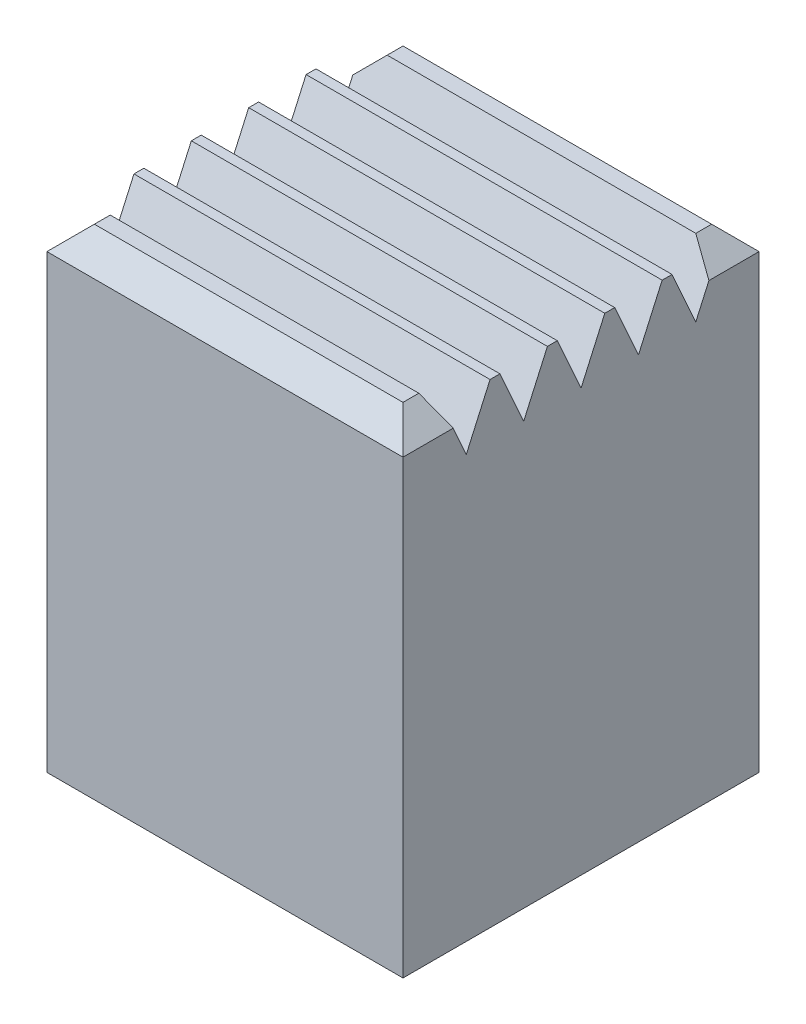
ISO-10303-21;
HEADER;
FILE_DESCRIPTION(('STEP AP214'),'2;1');
FILE_NAME('part.step','',(''),(''),'','','');
FILE_SCHEMA(('AUTOMOTIVE_DESIGN { 1 0 10303 214 1 1 1 1 }'));
ENDSEC;
DATA;
#1=APPLICATION_CONTEXT('core data for automotive mechanical design processes');
#2=APPLICATION_PROTOCOL_DEFINITION('international standard','automotive_design',2000,#1);
#3=PRODUCT_CONTEXT('',#1,'mechanical');
#4=PRODUCT('Part','Part','',(#3));
#5=PRODUCT_RELATED_PRODUCT_CATEGORY('part','',(#4));
#6=PRODUCT_DEFINITION_FORMATION('','',#4);
#7=PRODUCT_DEFINITION_CONTEXT('part definition',#1,'design');
#8=PRODUCT_DEFINITION('design','',#6,#7);
#9=PRODUCT_DEFINITION_SHAPE('','',#8);
#10=(LENGTH_UNIT() NAMED_UNIT(*) SI_UNIT(.MILLI.,.METRE.));
#11=(NAMED_UNIT(*) PLANE_ANGLE_UNIT() SI_UNIT($,.RADIAN.));
#12=(NAMED_UNIT(*) SI_UNIT($,.STERADIAN.) SOLID_ANGLE_UNIT());
#13=UNCERTAINTY_MEASURE_WITH_UNIT(LENGTH_MEASURE(1.E-05),#10,'distance_accuracy_value','');
#14=(GEOMETRIC_REPRESENTATION_CONTEXT(3) GLOBAL_UNCERTAINTY_ASSIGNED_CONTEXT((#13)) GLOBAL_UNIT_ASSIGNED_CONTEXT((#10,
#11,#12)) REPRESENTATION_CONTEXT('',''));
#15=CARTESIAN_POINT('',(0.,0.,0.));
#16=DIRECTION('',(0.,0.,1.));
#17=DIRECTION('',(1.,0.,0.));
#18=AXIS2_PLACEMENT_3D('',#15,#16,#17);
#19=CARTESIAN_POINT('',(0.,6.,0.));
#20=DIRECTION('',(0.,-1.,0.));
#21=DIRECTION('',(0.,0.,-1.));
#22=AXIS2_PLACEMENT_3D('',#19,#20,#21);
#23=PLANE('',#22);
#24=DIRECTION('',(0.,0.,1.));
#25=VECTOR('',#24,1.);
#26=CARTESIAN_POINT('',(0.,6.,0.));
#27=LINE('',#26,#25);
#28=CARTESIAN_POINT('',(0.,6.,-3.4));
#29=VERTEX_POINT('',#28);
#30=CARTESIAN_POINT('',(0.,6.,-3.275));
#31=VERTEX_POINT('',#30);
#32=EDGE_CURVE('E417',#29,#31,#27,.T.);
#33=ORIENTED_EDGE('',*,*,#32,.T.);
#34=DIRECTION('',(-1.,0.,0.));
#35=VECTOR('',#34,1.);
#36=CARTESIAN_POINT('',(5.3993886812719,6.,-3.275));
#37=LINE('',#36,#35);
#38=CARTESIAN_POINT('',(4.5,6.,-3.275));
#39=VERTEX_POINT('',#38);
#40=EDGE_CURVE('E246',#39,#31,#37,.T.);
#41=ORIENTED_EDGE('',*,*,#40,.F.);
#42=DIRECTION('',(0.,0.,-1.));
#43=VECTOR('',#42,1.);
#44=CARTESIAN_POINT('',(4.5,6.,0.));
#45=LINE('',#44,#43);
#46=CARTESIAN_POINT('',(4.5,6.,-3.4));
#47=VERTEX_POINT('',#46);
#48=EDGE_CURVE('E418',#39,#47,#45,.T.);
#49=ORIENTED_EDGE('',*,*,#48,.T.);
#50=DIRECTION('',(-1.,0.,0.));
#51=VECTOR('',#50,1.);
#52=CARTESIAN_POINT('',(5.3993886812719,6.,-3.4));
#53=LINE('',#52,#51);
#54=EDGE_CURVE('E357',#47,#29,#53,.T.);
#55=ORIENTED_EDGE('',*,*,#54,.T.);
#56=EDGE_LOOP('',(#33,#41,#49,#55));
#57=FACE_BOUND('',#56,.T.);
#58=ADVANCED_FACE('F47',(#57),#23,.F.);
#59=CARTESIAN_POINT('',(4.5,6.,-2.55));
#60=VERTEX_POINT('',#59);
#61=CARTESIAN_POINT('',(4.5,6.,-2.675));
#62=VERTEX_POINT('',#61);
#63=EDGE_CURVE('E421',#60,#62,#45,.T.);
#64=ORIENTED_EDGE('',*,*,#63,.T.);
#65=DIRECTION('',(-1.,0.,0.));
#66=VECTOR('',#65,1.);
#67=CARTESIAN_POINT('',(5.3993886812719,6.,-2.675));
#68=LINE('',#67,#66);
#69=CARTESIAN_POINT('',(0.,6.,-2.675));
#70=VERTEX_POINT('',#69);
#71=EDGE_CURVE('E240',#62,#70,#68,.T.);
#72=ORIENTED_EDGE('',*,*,#71,.T.);
#73=CARTESIAN_POINT('',(0.,6.,-2.55));
#74=VERTEX_POINT('',#73);
#75=EDGE_CURVE('E258',#70,#74,#27,.T.);
#76=ORIENTED_EDGE('',*,*,#75,.T.);
#77=DIRECTION('',(-1.,0.,0.));
#78=VECTOR('',#77,1.);
#79=CARTESIAN_POINT('',(5.3993886812719,6.,-2.55));
#80=LINE('',#79,#78);
#81=EDGE_CURVE('E275',#60,#74,#80,.T.);
#82=ORIENTED_EDGE('',*,*,#81,.F.);
#83=EDGE_LOOP('',(#64,#72,#76,#82));
#84=FACE_BOUND('',#83,.T.);
#85=ADVANCED_FACE('F565',(#84),#23,.F.);
#86=CARTESIAN_POINT('',(4.5,6.,-1.825));
#87=VERTEX_POINT('',#86);
#88=CARTESIAN_POINT('',(4.5,6.,-1.95));
#89=VERTEX_POINT('',#88);
#90=EDGE_CURVE('E556',#87,#89,#45,.T.);
#91=ORIENTED_EDGE('',*,*,#90,.T.);
#92=DIRECTION('',(-1.,0.,0.));
#93=VECTOR('',#92,1.);
#94=CARTESIAN_POINT('',(5.3993886812719,6.,-1.95));
#95=LINE('',#94,#93);
#96=CARTESIAN_POINT('',(0.,6.,-1.95));
#97=VERTEX_POINT('',#96);
#98=EDGE_CURVE('E287',#89,#97,#95,.T.);
#99=ORIENTED_EDGE('',*,*,#98,.T.);
#100=CARTESIAN_POINT('',(0.,6.,-1.825));
#101=VERTEX_POINT('',#100);
#102=EDGE_CURVE('E415',#97,#101,#27,.T.);
#103=ORIENTED_EDGE('',*,*,#102,.T.);
#104=DIRECTION('',(-1.,0.,0.));
#105=VECTOR('',#104,1.);
#106=CARTESIAN_POINT('',(5.3993886812719,6.,-1.825));
#107=LINE('',#106,#105);
#108=EDGE_CURVE('E298',#87,#101,#107,.T.);
#109=ORIENTED_EDGE('',*,*,#108,.F.);
#110=EDGE_LOOP('',(#91,#99,#103,#109));
#111=FACE_BOUND('',#110,.T.);
#112=ADVANCED_FACE('F542',(#111),#23,.F.);
#113=CARTESIAN_POINT('',(4.5,6.,-1.1));
#114=VERTEX_POINT('',#113);
#115=CARTESIAN_POINT('',(4.5,6.,-1.225));
#116=VERTEX_POINT('',#115);
#117=EDGE_CURVE('E422',#114,#116,#45,.T.);
#118=ORIENTED_EDGE('',*,*,#117,.T.);
#119=DIRECTION('',(-1.,0.,0.));
#120=VECTOR('',#119,1.);
#121=CARTESIAN_POINT('',(5.3993886812719,6.,-1.225));
#122=LINE('',#121,#120);
#123=CARTESIAN_POINT('',(0.,6.,-1.225));
#124=VERTEX_POINT('',#123);
#125=EDGE_CURVE('E310',#116,#124,#122,.T.);
#126=ORIENTED_EDGE('',*,*,#125,.T.);
#127=CARTESIAN_POINT('',(0.,6.,-1.1));
#128=VERTEX_POINT('',#127);
#129=EDGE_CURVE('E411',#124,#128,#27,.T.);
#130=ORIENTED_EDGE('',*,*,#129,.T.);
#131=DIRECTION('',(-1.,0.,0.));
#132=VECTOR('',#131,1.);
#133=CARTESIAN_POINT('',(5.3993886812719,6.,-1.1));
#134=LINE('',#133,#132);
#135=EDGE_CURVE('E321',#114,#128,#134,.T.);
#136=ORIENTED_EDGE('',*,*,#135,.F.);
#137=EDGE_LOOP('',(#118,#126,#130,#136));
#138=FACE_BOUND('',#137,.T.);
#139=ADVANCED_FACE('F621',(#138),#23,.F.);
#140=DIRECTION('',(-1.,0.,0.));
#141=VECTOR('',#140,1.);
#142=CARTESIAN_POINT('',(0.,6.,-4.2));
#143=LINE('',#142,#141);
#144=CARTESIAN_POINT('',(4.2,6.,-4.2));
#145=VERTEX_POINT('',#144);
#146=CARTESIAN_POINT('',(0.300000000000002,6.,-4.2));
#147=VERTEX_POINT('',#146);
#148=EDGE_CURVE('E66',#145,#147,#143,.T.);
#149=ORIENTED_EDGE('',*,*,#148,.T.);
#150=DIRECTION('',(0.,0.,1.));
#151=VECTOR('',#150,1.);
#152=CARTESIAN_POINT('',(0.300000000000002,6.,0.));
#153=LINE('',#152,#151);
#154=CARTESIAN_POINT('',(0.300000000000002,6.,-4.));
#155=VERTEX_POINT('',#154);
#156=EDGE_CURVE('E484',#147,#155,#153,.T.);
#157=ORIENTED_EDGE('',*,*,#156,.T.);
#158=DIRECTION('',(-1.,0.,0.));
#159=VECTOR('',#158,1.);
#160=CARTESIAN_POINT('',(5.3993886812719,6.,-4.));
#161=LINE('',#160,#159);
#162=CARTESIAN_POINT('',(4.2,6.,-4.));
#163=VERTEX_POINT('',#162);
#164=EDGE_CURVE('E347',#163,#155,#161,.T.);
#165=ORIENTED_EDGE('',*,*,#164,.F.);
#166=DIRECTION('',(0.,0.,-1.));
#167=VECTOR('',#166,1.);
#168=CARTESIAN_POINT('',(4.2,6.,0.));
#169=LINE('',#168,#167);
#170=EDGE_CURVE('E71',#163,#145,#169,.T.);
#171=ORIENTED_EDGE('',*,*,#170,.T.);
#172=EDGE_LOOP('',(#149,#157,#165,#171));
#173=FACE_BOUND('',#172,.T.);
#174=ADVANCED_FACE('F610',(#173),#23,.F.);
#175=CARTESIAN_POINT('',(0.,6.,0.));
#176=DIRECTION('',(1.,0.,0.));
#177=DIRECTION('',(0.,0.,-1.));
#178=AXIS2_PLACEMENT_3D('',#175,#176,#177);
#179=PLANE('',#178);
#180=DIRECTION('',(0.,-1.,0.));
#181=VECTOR('',#180,1.);
#182=CARTESIAN_POINT('',(0.,6.,0.));
#183=LINE('',#182,#181);
#184=CARTESIAN_POINT('',(0.,5.7,0.));
#185=VERTEX_POINT('',#184);
#186=CARTESIAN_POINT('',(0.,0.,0.));
#187=VERTEX_POINT('',#186);
#188=EDGE_CURVE('E446',#185,#187,#183,.T.);
#189=ORIENTED_EDGE('',*,*,#188,.F.);
#190=DIRECTION('',(0.,0.,-1.));
#191=VECTOR('',#190,1.);
#192=CARTESIAN_POINT('',(0.,5.7,0.));
#193=LINE('',#192,#191);
#194=CARTESIAN_POINT('',(0.,5.7,-0.634328358208955));
#195=VERTEX_POINT('',#194);
#196=EDGE_CURVE('E477',#185,#195,#193,.T.);
#197=ORIENTED_EDGE('',*,*,#196,.T.);
#198=DIRECTION('',(0.,0.912684575394031,0.408664735251058));
#199=VECTOR('',#198,1.);
#200=CARTESIAN_POINT('',(0.,5.33,-0.8));
#201=LINE('',#200,#199);
#202=CARTESIAN_POINT('',(0.,5.33,-0.8));
#203=VERTEX_POINT('',#202);
#204=EDGE_CURVE('E326',#203,#195,#201,.T.);
#205=ORIENTED_EDGE('',*,*,#204,.F.);
#206=DIRECTION('',(0.,-0.912684575394031,0.408664735251058));
#207=VECTOR('',#206,1.);
#208=CARTESIAN_POINT('',(0.,6.,-1.1));
#209=LINE('',#208,#207);
#210=EDGE_CURVE('E322',#128,#203,#209,.T.);
#211=ORIENTED_EDGE('',*,*,#210,.F.);
#212=ORIENTED_EDGE('',*,*,#129,.F.);
#213=DIRECTION('',(0.,0.912684575394031,0.408664735251058));
#214=VECTOR('',#213,1.);
#215=CARTESIAN_POINT('',(0.,5.33,-1.525));
#216=LINE('',#215,#214);
#217=CARTESIAN_POINT('',(0.,5.33,-1.525));
#218=VERTEX_POINT('',#217);
#219=EDGE_CURVE('E303',#218,#124,#216,.T.);
#220=ORIENTED_EDGE('',*,*,#219,.F.);
#221=DIRECTION('',(0.,-0.912684575394031,0.408664735251058));
#222=VECTOR('',#221,1.);
#223=CARTESIAN_POINT('',(0.,6.,-1.825));
#224=LINE('',#223,#222);
#225=EDGE_CURVE('E299',#101,#218,#224,.T.);
#226=ORIENTED_EDGE('',*,*,#225,.F.);
#227=ORIENTED_EDGE('',*,*,#102,.F.);
#228=DIRECTION('',(0.,0.912684575394031,0.408664735251058));
#229=VECTOR('',#228,1.);
#230=CARTESIAN_POINT('',(0.,5.33,-2.25));
#231=LINE('',#230,#229);
#232=CARTESIAN_POINT('',(0.,5.33,-2.25));
#233=VERTEX_POINT('',#232);
#234=EDGE_CURVE('E280',#233,#97,#231,.T.);
#235=ORIENTED_EDGE('',*,*,#234,.F.);
#236=DIRECTION('',(0.,-0.912684575394031,0.408664735251058));
#237=VECTOR('',#236,1.);
#238=CARTESIAN_POINT('',(0.,6.,-2.55));
#239=LINE('',#238,#237);
#240=EDGE_CURVE('E276',#74,#233,#239,.T.);
#241=ORIENTED_EDGE('',*,*,#240,.F.);
#242=ORIENTED_EDGE('',*,*,#75,.F.);
#243=DIRECTION('',(0.,0.912684575394031,0.408664735251058));
#244=VECTOR('',#243,1.);
#245=CARTESIAN_POINT('',(0.,5.33,-2.975));
#246=LINE('',#245,#244);
#247=CARTESIAN_POINT('',(0.,5.33,-2.975));
#248=VERTEX_POINT('',#247);
#249=EDGE_CURVE('E233',#248,#70,#246,.T.);
#250=ORIENTED_EDGE('',*,*,#249,.F.);
#251=DIRECTION('',(0.,-0.912684575394031,0.408664735251058));
#252=VECTOR('',#251,1.);
#253=CARTESIAN_POINT('',(0.,6.,-3.275));
#254=LINE('',#253,#252);
#255=EDGE_CURVE('E243',#31,#248,#254,.T.);
#256=ORIENTED_EDGE('',*,*,#255,.F.);
#257=ORIENTED_EDGE('',*,*,#32,.F.);
#258=DIRECTION('',(0.,0.912684575394031,0.408664735251058));
#259=VECTOR('',#258,1.);
#260=CARTESIAN_POINT('',(0.,5.33,-3.7));
#261=LINE('',#260,#259);
#262=CARTESIAN_POINT('',(0.,5.33,-3.7));
#263=VERTEX_POINT('',#262);
#264=EDGE_CURVE('E350',#263,#29,#261,.T.);
#265=ORIENTED_EDGE('',*,*,#264,.F.);
#266=DIRECTION('',(0.,-0.912684575394031,0.408664735251058));
#267=VECTOR('',#266,1.);
#268=CARTESIAN_POINT('',(0.,6.,-4.));
#269=LINE('',#268,#267);
#270=CARTESIAN_POINT('',(0.,5.7,-3.86567164179104));
#271=VERTEX_POINT('',#270);
#272=EDGE_CURVE('E271',#271,#263,#269,.T.);
#273=ORIENTED_EDGE('',*,*,#272,.F.);
#274=DIRECTION('',(0.,0.,-1.));
#275=VECTOR('',#274,1.);
#276=CARTESIAN_POINT('',(0.,5.7,0.));
#277=LINE('',#276,#275);
#278=CARTESIAN_POINT('',(0.,5.7,-4.5));
#279=VERTEX_POINT('',#278);
#280=EDGE_CURVE('E474',#271,#279,#277,.T.);
#281=ORIENTED_EDGE('',*,*,#280,.T.);
#282=DIRECTION('',(0.,-1.,0.));
#283=VECTOR('',#282,1.);
#284=CARTESIAN_POINT('',(0.,6.,-4.5));
#285=LINE('',#284,#283);
#286=CARTESIAN_POINT('',(0.,0.,-4.5));
#287=VERTEX_POINT('',#286);
#288=EDGE_CURVE('E437',#279,#287,#285,.T.);
#289=ORIENTED_EDGE('',*,*,#288,.T.);
#290=DIRECTION('',(0.,0.,1.));
#291=VECTOR('',#290,1.);
#292=CARTESIAN_POINT('',(0.,0.,0.));
#293=LINE('',#292,#291);
#294=EDGE_CURVE('E401',#287,#187,#293,.T.);
#295=ORIENTED_EDGE('',*,*,#294,.T.);
#296=EDGE_LOOP('',(#189,#197,#205,#211,#212,#220,#226,#227,#235,#241,#242,#250,#256,#257,#265,
#273,#281,#289,#295));
#297=FACE_BOUND('',#296,.T.);
#298=ADVANCED_FACE('F255',(#297),#179,.F.);
#299=CARTESIAN_POINT('',(0.,6.,0.));
#300=DIRECTION('',(0.,0.,-1.));
#301=DIRECTION('',(-1.,0.,0.));
#302=AXIS2_PLACEMENT_3D('',#299,#300,#301);
#303=PLANE('',#302);
#304=DIRECTION('',(0.,-1.,0.));
#305=VECTOR('',#304,1.);
#306=CARTESIAN_POINT('',(4.5,6.,0.));
#307=LINE('',#306,#305);
#308=CARTESIAN_POINT('',(4.5,5.7,0.));
#309=VERTEX_POINT('',#308);
#310=CARTESIAN_POINT('',(4.5,0.,0.));
#311=VERTEX_POINT('',#310);
#312=EDGE_CURVE('E443',#309,#311,#307,.T.);
#313=ORIENTED_EDGE('',*,*,#312,.F.);
#314=DIRECTION('',(-1.,0.,0.));
#315=VECTOR('',#314,1.);
#316=CARTESIAN_POINT('',(0.,5.7,0.));
#317=LINE('',#316,#315);
#318=EDGE_CURVE('E471',#309,#185,#317,.T.);
#319=ORIENTED_EDGE('',*,*,#318,.T.);
#320=ORIENTED_EDGE('',*,*,#188,.T.);
#321=DIRECTION('',(1.,0.,0.));
#322=VECTOR('',#321,1.);
#323=CARTESIAN_POINT('',(0.,0.,0.));
#324=LINE('',#323,#322);
#325=EDGE_CURVE('E426',#187,#311,#324,.T.);
#326=ORIENTED_EDGE('',*,*,#325,.T.);
#327=EDGE_LOOP('',(#313,#319,#320,#326));
#328=FACE_BOUND('',#327,.T.);
#329=ADVANCED_FACE('F626',(#328),#303,.F.);
#330=CARTESIAN_POINT('',(4.5,6.,0.));
#331=DIRECTION('',(-1.,0.,0.));
#332=DIRECTION('',(0.,0.,1.));
#333=AXIS2_PLACEMENT_3D('',#330,#331,#332);
#334=PLANE('',#333);
#335=DIRECTION('',(0.,-0.912684575394031,-0.408664735251058));
#336=VECTOR('',#335,1.);
#337=CARTESIAN_POINT('',(4.5,5.33,-0.8));
#338=LINE('',#337,#336);
#339=CARTESIAN_POINT('',(4.5,5.7,-0.634328358208955));
#340=VERTEX_POINT('',#339);
#341=CARTESIAN_POINT('',(4.5,5.33,-0.8));
#342=VERTEX_POINT('',#341);
#343=EDGE_CURVE('E304',#340,#342,#338,.T.);
#344=ORIENTED_EDGE('',*,*,#343,.F.);
#345=DIRECTION('',(0.,0.,1.));
#346=VECTOR('',#345,1.);
#347=CARTESIAN_POINT('',(4.5,5.7,0.));
#348=LINE('',#347,#346);
#349=EDGE_CURVE('E468',#340,#309,#348,.T.);
#350=ORIENTED_EDGE('',*,*,#349,.T.);
#351=ORIENTED_EDGE('',*,*,#312,.T.);
#352=DIRECTION('',(0.,0.,-1.));
#353=VECTOR('',#352,1.);
#354=CARTESIAN_POINT('',(4.5,0.,0.));
#355=LINE('',#354,#353);
#356=CARTESIAN_POINT('',(4.5,0.,-4.5));
#357=VERTEX_POINT('',#356);
#358=EDGE_CURVE('E430',#311,#357,#355,.T.);
#359=ORIENTED_EDGE('',*,*,#358,.T.);
#360=DIRECTION('',(0.,-1.,0.));
#361=VECTOR('',#360,1.);
#362=CARTESIAN_POINT('',(4.5,6.,-4.5));
#363=LINE('',#362,#361);
#364=CARTESIAN_POINT('',(4.5,5.7,-4.5));
#365=VERTEX_POINT('',#364);
#366=EDGE_CURVE('E440',#365,#357,#363,.T.);
#367=ORIENTED_EDGE('',*,*,#366,.F.);
#368=DIRECTION('',(0.,0.,1.));
#369=VECTOR('',#368,1.);
#370=CARTESIAN_POINT('',(4.5,5.7,0.));
#371=LINE('',#370,#369);
#372=CARTESIAN_POINT('',(4.5,5.7,-3.86567164179104));
#373=VERTEX_POINT('',#372);
#374=EDGE_CURVE('E465',#365,#373,#371,.T.);
#375=ORIENTED_EDGE('',*,*,#374,.T.);
#376=DIRECTION('',(0.,0.912684575394031,-0.408664735251058));
#377=VECTOR('',#376,1.);
#378=CARTESIAN_POINT('',(4.5,6.,-4.));
#379=LINE('',#378,#377);
#380=CARTESIAN_POINT('',(4.5,5.33,-3.7));
#381=VERTEX_POINT('',#380);
#382=EDGE_CURVE('E342',#381,#373,#379,.T.);
#383=ORIENTED_EDGE('',*,*,#382,.F.);
#384=DIRECTION('',(0.,-0.912684575394031,-0.408664735251058));
#385=VECTOR('',#384,1.);
#386=CARTESIAN_POINT('',(4.5,5.33,-3.7));
#387=LINE('',#386,#385);
#388=EDGE_CURVE('E346',#47,#381,#387,.T.);
#389=ORIENTED_EDGE('',*,*,#388,.F.);
#390=ORIENTED_EDGE('',*,*,#48,.F.);
#391=DIRECTION('',(0.,0.912684575394031,-0.408664735251058));
#392=VECTOR('',#391,1.);
#393=CARTESIAN_POINT('',(4.5,6.,-3.275));
#394=LINE('',#393,#392);
#395=CARTESIAN_POINT('',(4.5,5.33,-2.975));
#396=VERTEX_POINT('',#395);
#397=EDGE_CURVE('E266',#396,#39,#394,.T.);
#398=ORIENTED_EDGE('',*,*,#397,.F.);
#399=DIRECTION('',(0.,-0.912684575394031,-0.408664735251058));
#400=VECTOR('',#399,1.);
#401=CARTESIAN_POINT('',(4.5,5.33,-2.975));
#402=LINE('',#401,#400);
#403=EDGE_CURVE('E236',#62,#396,#402,.T.);
#404=ORIENTED_EDGE('',*,*,#403,.F.);
#405=ORIENTED_EDGE('',*,*,#63,.F.);
#406=DIRECTION('',(0.,0.912684575394031,-0.408664735251058));
#407=VECTOR('',#406,1.);
#408=CARTESIAN_POINT('',(4.5,6.,-2.55));
#409=LINE('',#408,#407);
#410=CARTESIAN_POINT('',(4.5,5.33,-2.25));
#411=VERTEX_POINT('',#410);
#412=EDGE_CURVE('E272',#411,#60,#409,.T.);
#413=ORIENTED_EDGE('',*,*,#412,.F.);
#414=DIRECTION('',(0.,-0.912684575394031,-0.408664735251058));
#415=VECTOR('',#414,1.);
#416=CARTESIAN_POINT('',(4.5,5.33,-2.25));
#417=LINE('',#416,#415);
#418=EDGE_CURVE('E251',#89,#411,#417,.T.);
#419=ORIENTED_EDGE('',*,*,#418,.F.);
#420=ORIENTED_EDGE('',*,*,#90,.F.);
#421=DIRECTION('',(0.,0.912684575394031,-0.408664735251058));
#422=VECTOR('',#421,1.);
#423=CARTESIAN_POINT('',(4.5,6.,-1.825));
#424=LINE('',#423,#422);
#425=CARTESIAN_POINT('',(4.5,5.33,-1.525));
#426=VERTEX_POINT('',#425);
#427=EDGE_CURVE('E295',#426,#87,#424,.T.);
#428=ORIENTED_EDGE('',*,*,#427,.F.);
#429=DIRECTION('',(0.,-0.912684575394031,-0.408664735251058));
#430=VECTOR('',#429,1.);
#431=CARTESIAN_POINT('',(4.5,5.33,-1.525));
#432=LINE('',#431,#430);
#433=EDGE_CURVE('E281',#116,#426,#432,.T.);
#434=ORIENTED_EDGE('',*,*,#433,.F.);
#435=ORIENTED_EDGE('',*,*,#117,.F.);
#436=DIRECTION('',(0.,0.912684575394031,-0.408664735251058));
#437=VECTOR('',#436,1.);
#438=CARTESIAN_POINT('',(4.5,6.,-1.1));
#439=LINE('',#438,#437);
#440=EDGE_CURVE('E318',#342,#114,#439,.T.);
#441=ORIENTED_EDGE('',*,*,#440,.F.);
#442=EDGE_LOOP('',(#344,#350,#351,#359,#367,#375,#383,#389,#390,#398,#404,#405,#413,#419,#420,
#428,#434,#435,#441));
#443=FACE_BOUND('',#442,.T.);
#444=ADVANCED_FACE('F518',(#443),#334,.F.);
#445=CARTESIAN_POINT('',(0.,6.,-4.5));
#446=DIRECTION('',(0.,0.,1.));
#447=DIRECTION('',(1.,0.,0.));
#448=AXIS2_PLACEMENT_3D('',#445,#446,#447);
#449=PLANE('',#448);
#450=ORIENTED_EDGE('',*,*,#288,.F.);
#451=DIRECTION('',(1.,0.,0.));
#452=VECTOR('',#451,1.);
#453=CARTESIAN_POINT('',(0.,5.7,-4.5));
#454=LINE('',#453,#452);
#455=EDGE_CURVE('E11',#279,#365,#454,.T.);
#456=ORIENTED_EDGE('',*,*,#455,.T.);
#457=ORIENTED_EDGE('',*,*,#366,.T.);
#458=DIRECTION('',(-1.,0.,0.));
#459=VECTOR('',#458,1.);
#460=CARTESIAN_POINT('',(0.,0.,-4.5));
#461=LINE('',#460,#459);
#462=EDGE_CURVE('E416',#357,#287,#461,.T.);
#463=ORIENTED_EDGE('',*,*,#462,.T.);
#464=EDGE_LOOP('',(#450,#456,#457,#463));
#465=FACE_BOUND('',#464,.T.);
#466=ADVANCED_FACE('F608',(#465),#449,.F.);
#467=DIRECTION('',(1.,0.,0.));
#468=VECTOR('',#467,1.);
#469=CARTESIAN_POINT('',(0.,6.,-0.3));
#470=LINE('',#469,#468);
#471=CARTESIAN_POINT('',(0.3,6.,-0.3));
#472=VERTEX_POINT('',#471);
#473=CARTESIAN_POINT('',(4.2,6.,-0.3));
#474=VERTEX_POINT('',#473);
#475=EDGE_CURVE('E452',#472,#474,#470,.T.);
#476=ORIENTED_EDGE('',*,*,#475,.T.);
#477=DIRECTION('',(0.,0.,-1.));
#478=VECTOR('',#477,1.);
#479=CARTESIAN_POINT('',(4.2,6.,0.));
#480=LINE('',#479,#478);
#481=CARTESIAN_POINT('',(4.2,6.,-0.5));
#482=VERTEX_POINT('',#481);
#483=EDGE_CURVE('E455',#474,#482,#480,.T.);
#484=ORIENTED_EDGE('',*,*,#483,.T.);
#485=DIRECTION('',(-1.,0.,0.));
#486=VECTOR('',#485,1.);
#487=CARTESIAN_POINT('',(5.3993886812719,6.,-0.5));
#488=LINE('',#487,#486);
#489=CARTESIAN_POINT('',(0.3,6.,-0.5));
#490=VERTEX_POINT('',#489);
#491=EDGE_CURVE('E334',#482,#490,#488,.T.);
#492=ORIENTED_EDGE('',*,*,#491,.T.);
#493=DIRECTION('',(0.,0.,1.));
#494=VECTOR('',#493,1.);
#495=CARTESIAN_POINT('',(0.3,6.,0.));
#496=LINE('',#495,#494);
#497=EDGE_CURVE('E449',#490,#472,#496,.T.);
#498=ORIENTED_EDGE('',*,*,#497,.T.);
#499=EDGE_LOOP('',(#476,#484,#492,#498));
#500=FACE_BOUND('',#499,.T.);
#501=ADVANCED_FACE('F599',(#500),#23,.F.);
#502=CARTESIAN_POINT('',(0.,0.,0.));
#503=DIRECTION('',(0.,-1.,0.));
#504=DIRECTION('',(0.,0.,-1.));
#505=AXIS2_PLACEMENT_3D('',#502,#503,#504);
#506=PLANE('',#505);
#507=DIRECTION('',(0.,0.,-1.));
#508=VECTOR('',#507,1.);
#509=CARTESIAN_POINT('',(0.65,0.,-0.65));
#510=LINE('',#509,#508);
#511=CARTESIAN_POINT('',(0.65,0.,-0.65));
#512=VERTEX_POINT('',#511);
#513=CARTESIAN_POINT('',(0.65,0.,-3.85));
#514=VERTEX_POINT('',#513);
#515=EDGE_CURVE('E366',#512,#514,#510,.T.);
#516=ORIENTED_EDGE('',*,*,#515,.F.);
#517=DIRECTION('',(-1.,0.,0.));
#518=VECTOR('',#517,1.);
#519=CARTESIAN_POINT('',(0.65,0.,-0.65));
#520=LINE('',#519,#518);
#521=CARTESIAN_POINT('',(3.85,0.,-0.65));
#522=VERTEX_POINT('',#521);
#523=EDGE_CURVE('E372',#522,#512,#520,.T.);
#524=ORIENTED_EDGE('',*,*,#523,.F.);
#525=DIRECTION('',(0.,0.,1.));
#526=VECTOR('',#525,1.);
#527=CARTESIAN_POINT('',(3.85,0.,-0.65));
#528=LINE('',#527,#526);
#529=CARTESIAN_POINT('',(3.85,0.,-3.85));
#530=VERTEX_POINT('',#529);
#531=EDGE_CURVE('E391',#530,#522,#528,.T.);
#532=ORIENTED_EDGE('',*,*,#531,.F.);
#533=DIRECTION('',(1.,0.,0.));
#534=VECTOR('',#533,1.);
#535=CARTESIAN_POINT('',(0.65,0.,-3.85));
#536=LINE('',#535,#534);
#537=EDGE_CURVE('E387',#514,#530,#536,.T.);
#538=ORIENTED_EDGE('',*,*,#537,.F.);
#539=EDGE_LOOP('',(#516,#524,#532,#538));
#540=FACE_BOUND('',#539,.T.);
#541=ORIENTED_EDGE('',*,*,#294,.F.);
#542=ORIENTED_EDGE('',*,*,#462,.F.);
#543=ORIENTED_EDGE('',*,*,#358,.F.);
#544=ORIENTED_EDGE('',*,*,#325,.F.);
#545=EDGE_LOOP('',(#541,#542,#543,#544));
#546=FACE_BOUND('',#545,.T.);
#547=ADVANCED_FACE('F607',(#540,#546),#506,.T.);
#548=CARTESIAN_POINT('',(0.65,4.9,-0.65));
#549=DIRECTION('',(-1.,0.,0.));
#550=DIRECTION('',(0.,0.,1.));
#551=AXIS2_PLACEMENT_3D('',#548,#549,#550);
#552=PLANE('',#551);
#553=ORIENTED_EDGE('',*,*,#515,.T.);
#554=DIRECTION('',(0.,-1.,0.));
#555=VECTOR('',#554,1.);
#556=CARTESIAN_POINT('',(0.65,4.9,-3.85));
#557=LINE('',#556,#555);
#558=CARTESIAN_POINT('',(0.65,4.9,-3.85));
#559=VERTEX_POINT('',#558);
#560=EDGE_CURVE('E384',#559,#514,#557,.T.);
#561=ORIENTED_EDGE('',*,*,#560,.F.);
#562=DIRECTION('',(0.,0.,-1.));
#563=VECTOR('',#562,1.);
#564=CARTESIAN_POINT('',(0.65,4.9,-0.65));
#565=LINE('',#564,#563);
#566=CARTESIAN_POINT('',(0.65,4.9,-0.65));
#567=VERTEX_POINT('',#566);
#568=EDGE_CURVE('E367',#567,#559,#565,.T.);
#569=ORIENTED_EDGE('',*,*,#568,.F.);
#570=DIRECTION('',(0.,-1.,0.));
#571=VECTOR('',#570,1.);
#572=CARTESIAN_POINT('',(0.65,4.9,-0.65));
#573=LINE('',#572,#571);
#574=EDGE_CURVE('E398',#567,#512,#573,.T.);
#575=ORIENTED_EDGE('',*,*,#574,.T.);
#576=EDGE_LOOP('',(#553,#561,#569,#575));
#577=FACE_BOUND('',#576,.T.);
#578=ADVANCED_FACE('F616',(#577),#552,.F.);
#579=CARTESIAN_POINT('',(0.65,4.9,-0.65));
#580=DIRECTION('',(0.,0.,1.));
#581=DIRECTION('',(1.,0.,0.));
#582=AXIS2_PLACEMENT_3D('',#579,#580,#581);
#583=PLANE('',#582);
#584=ORIENTED_EDGE('',*,*,#523,.T.);
#585=ORIENTED_EDGE('',*,*,#574,.F.);
#586=DIRECTION('',(-1.,0.,0.));
#587=VECTOR('',#586,1.);
#588=CARTESIAN_POINT('',(0.65,4.9,-0.65));
#589=LINE('',#588,#587);
#590=CARTESIAN_POINT('',(3.85,4.9,-0.65));
#591=VERTEX_POINT('',#590);
#592=EDGE_CURVE('E380',#591,#567,#589,.T.);
#593=ORIENTED_EDGE('',*,*,#592,.F.);
#594=DIRECTION('',(0.,-1.,0.));
#595=VECTOR('',#594,1.);
#596=CARTESIAN_POINT('',(3.85,4.9,-0.65));
#597=LINE('',#596,#595);
#598=EDGE_CURVE('E402',#591,#522,#597,.T.);
#599=ORIENTED_EDGE('',*,*,#598,.T.);
#600=EDGE_LOOP('',(#584,#585,#593,#599));
#601=FACE_BOUND('',#600,.T.);
#602=ADVANCED_FACE('F730',(#601),#583,.F.);
#603=CARTESIAN_POINT('',(3.85,4.9,-0.65));
#604=DIRECTION('',(1.,0.,0.));
#605=DIRECTION('',(0.,0.,-1.));
#606=AXIS2_PLACEMENT_3D('',#603,#604,#605);
#607=PLANE('',#606);
#608=ORIENTED_EDGE('',*,*,#531,.T.);
#609=ORIENTED_EDGE('',*,*,#598,.F.);
#610=DIRECTION('',(0.,0.,1.));
#611=VECTOR('',#610,1.);
#612=CARTESIAN_POINT('',(3.85,4.9,-0.65));
#613=LINE('',#612,#611);
#614=CARTESIAN_POINT('',(3.85,4.9,-3.85));
#615=VERTEX_POINT('',#614);
#616=EDGE_CURVE('E376',#615,#591,#613,.T.);
#617=ORIENTED_EDGE('',*,*,#616,.F.);
#618=DIRECTION('',(0.,-1.,0.));
#619=VECTOR('',#618,1.);
#620=CARTESIAN_POINT('',(3.85,4.9,-3.85));
#621=LINE('',#620,#619);
#622=EDGE_CURVE('E405',#615,#530,#621,.T.);
#623=ORIENTED_EDGE('',*,*,#622,.T.);
#624=EDGE_LOOP('',(#608,#609,#617,#623));
#625=FACE_BOUND('',#624,.T.);
#626=ADVANCED_FACE('F739',(#625),#607,.F.);
#627=CARTESIAN_POINT('',(0.65,4.9,-3.85));
#628=DIRECTION('',(0.,0.,-1.));
#629=DIRECTION('',(-1.,0.,0.));
#630=AXIS2_PLACEMENT_3D('',#627,#628,#629);
#631=PLANE('',#630);
#632=ORIENTED_EDGE('',*,*,#537,.T.);
#633=ORIENTED_EDGE('',*,*,#622,.F.);
#634=DIRECTION('',(1.,0.,0.));
#635=VECTOR('',#634,1.);
#636=CARTESIAN_POINT('',(0.65,4.9,-3.85));
#637=LINE('',#636,#635);
#638=EDGE_CURVE('E371',#559,#615,#637,.T.);
#639=ORIENTED_EDGE('',*,*,#638,.F.);
#640=ORIENTED_EDGE('',*,*,#560,.T.);
#641=EDGE_LOOP('',(#632,#633,#639,#640));
#642=FACE_BOUND('',#641,.T.);
#643=ADVANCED_FACE('F749',(#642),#631,.F.);
#644=CARTESIAN_POINT('',(0.,4.9,0.));
#645=DIRECTION('',(0.,-1.,0.));
#646=DIRECTION('',(0.,0.,-1.));
#647=AXIS2_PLACEMENT_3D('',#644,#645,#646);
#648=PLANE('',#647);
#649=ORIENTED_EDGE('',*,*,#568,.T.);
#650=ORIENTED_EDGE('',*,*,#638,.T.);
#651=ORIENTED_EDGE('',*,*,#616,.T.);
#652=ORIENTED_EDGE('',*,*,#592,.T.);
#653=EDGE_LOOP('',(#649,#650,#651,#652));
#654=FACE_BOUND('',#653,.T.);
#655=ADVANCED_FACE('F759',(#654),#648,.T.);
#656=CARTESIAN_POINT('',(5.3993886812719,6.,-4.));
#657=DIRECTION('',(0.,-0.408664735251058,-0.912684575394031));
#658=DIRECTION('',(0.,0.912684575394031,-0.408664735251058));
#659=AXIS2_PLACEMENT_3D('',#656,#657,#658);
#660=PLANE('',#659);
#661=ORIENTED_EDGE('',*,*,#164,.T.);
#662=DIRECTION('',(0.674124780346804,0.674124780346804,-0.301846916573196));
#663=VECTOR('',#662,1.);
#664=CARTESIAN_POINT('',(-0.513929945333061,5.18607005466694,-3.63555375582102));
#665=LINE('',#664,#663);
#666=EDGE_CURVE('E58',#155,#271,#665,.F.);
#667=ORIENTED_EDGE('',*,*,#666,.T.);
#668=ORIENTED_EDGE('',*,*,#272,.T.);
#669=DIRECTION('',(-1.,0.,0.));
#670=VECTOR('',#669,1.);
#671=CARTESIAN_POINT('',(5.3993886812719,5.33,-3.7));
#672=LINE('',#671,#670);
#673=EDGE_CURVE('E353',#381,#263,#672,.T.);
#674=ORIENTED_EDGE('',*,*,#673,.F.);
#675=ORIENTED_EDGE('',*,*,#382,.T.);
#676=DIRECTION('',(0.674124780346804,-0.674124780346804,0.301846916573196));
#677=VECTOR('',#676,1.);
#678=CARTESIAN_POINT('',(5.01392994533306,5.18607005466694,-3.63555375582102));
#679=LINE('',#678,#677);
#680=EDGE_CURVE('E487',#373,#163,#679,.F.);
#681=ORIENTED_EDGE('',*,*,#680,.T.);
#682=EDGE_LOOP('',(#661,#667,#668,#674,#675,#681));
#683=FACE_BOUND('',#682,.T.);
#684=ADVANCED_FACE('F522',(#683),#660,.F.);
#685=CARTESIAN_POINT('',(5.3993886812719,5.33,-3.7));
#686=DIRECTION('',(0.,-0.408664735251058,0.912684575394031));
#687=DIRECTION('',(0.,-0.912684575394031,-0.408664735251058));
#688=AXIS2_PLACEMENT_3D('',#685,#686,#687);
#689=PLANE('',#688);
#690=ORIENTED_EDGE('',*,*,#388,.T.);
#691=ORIENTED_EDGE('',*,*,#673,.T.);
#692=ORIENTED_EDGE('',*,*,#264,.T.);
#693=ORIENTED_EDGE('',*,*,#54,.F.);
#694=EDGE_LOOP('',(#690,#691,#692,#693));
#695=FACE_BOUND('',#694,.T.);
#696=ADVANCED_FACE('F526',(#695),#689,.F.);
#697=CARTESIAN_POINT('',(5.3993886812719,6.,-1.1));
#698=DIRECTION('',(0.,-0.408664735251058,-0.912684575394031));
#699=DIRECTION('',(0.,0.912684575394031,-0.408664735251058));
#700=AXIS2_PLACEMENT_3D('',#697,#698,#699);
#701=PLANE('',#700);
#702=ORIENTED_EDGE('',*,*,#440,.T.);
#703=ORIENTED_EDGE('',*,*,#135,.T.);
#704=ORIENTED_EDGE('',*,*,#210,.T.);
#705=DIRECTION('',(-1.,0.,0.));
#706=VECTOR('',#705,1.);
#707=CARTESIAN_POINT('',(5.3993886812719,5.33,-0.8));
#708=LINE('',#707,#706);
#709=EDGE_CURVE('E331',#342,#203,#708,.T.);
#710=ORIENTED_EDGE('',*,*,#709,.F.);
#711=EDGE_LOOP('',(#702,#703,#704,#710));
#712=FACE_BOUND('',#711,.T.);
#713=ADVANCED_FACE('F639',(#712),#701,.F.);
#714=CARTESIAN_POINT('',(5.3993886812719,5.33,-0.8));
#715=DIRECTION('',(0.,-0.408664735251058,0.912684575394031));
#716=DIRECTION('',(0.,-0.912684575394031,-0.408664735251058));
#717=AXIS2_PLACEMENT_3D('',#714,#715,#716);
#718=PLANE('',#717);
#719=ORIENTED_EDGE('',*,*,#491,.F.);
#720=DIRECTION('',(-0.674124780346803,0.674124780346805,0.301846916573196));
#721=VECTOR('',#720,1.);
#722=CARTESIAN_POINT('',(4.09825875683337,6.10174124316663,-0.454444219477627));
#723=LINE('',#722,#721);
#724=EDGE_CURVE('E462',#482,#340,#723,.F.);
#725=ORIENTED_EDGE('',*,*,#724,.T.);
#726=ORIENTED_EDGE('',*,*,#343,.T.);
#727=ORIENTED_EDGE('',*,*,#709,.T.);
#728=ORIENTED_EDGE('',*,*,#204,.T.);
#729=DIRECTION('',(-0.674124780346803,-0.674124780346805,-0.301846916573196));
#730=VECTOR('',#729,1.);
#731=CARTESIAN_POINT('',(0.401741243166633,6.10174124316663,-0.454444219477627));
#732=LINE('',#731,#730);
#733=EDGE_CURVE('E459',#195,#490,#732,.F.);
#734=ORIENTED_EDGE('',*,*,#733,.T.);
#735=EDGE_LOOP('',(#719,#725,#726,#727,#728,#734));
#736=FACE_BOUND('',#735,.T.);
#737=ADVANCED_FACE('F644',(#736),#718,.F.);
#738=CARTESIAN_POINT('',(5.3993886812719,6.,-1.825));
#739=DIRECTION('',(0.,-0.408664735251058,-0.912684575394031));
#740=DIRECTION('',(0.,0.912684575394031,-0.408664735251058));
#741=AXIS2_PLACEMENT_3D('',#738,#739,#740);
#742=PLANE('',#741);
#743=ORIENTED_EDGE('',*,*,#427,.T.);
#744=ORIENTED_EDGE('',*,*,#108,.T.);
#745=ORIENTED_EDGE('',*,*,#225,.T.);
#746=DIRECTION('',(-1.,0.,0.));
#747=VECTOR('',#746,1.);
#748=CARTESIAN_POINT('',(5.3993886812719,5.33,-1.525));
#749=LINE('',#748,#747);
#750=EDGE_CURVE('E307',#426,#218,#749,.T.);
#751=ORIENTED_EDGE('',*,*,#750,.F.);
#752=EDGE_LOOP('',(#743,#744,#745,#751));
#753=FACE_BOUND('',#752,.T.);
#754=ADVANCED_FACE('F550',(#753),#742,.F.);
#755=CARTESIAN_POINT('',(5.3993886812719,5.33,-1.525));
#756=DIRECTION('',(0.,-0.408664735251058,0.912684575394031));
#757=DIRECTION('',(0.,-0.912684575394031,-0.408664735251058));
#758=AXIS2_PLACEMENT_3D('',#755,#756,#757);
#759=PLANE('',#758);
#760=ORIENTED_EDGE('',*,*,#433,.T.);
#761=ORIENTED_EDGE('',*,*,#750,.T.);
#762=ORIENTED_EDGE('',*,*,#219,.T.);
#763=ORIENTED_EDGE('',*,*,#125,.F.);
#764=EDGE_LOOP('',(#760,#761,#762,#763));
#765=FACE_BOUND('',#764,.T.);
#766=ADVANCED_FACE('F829',(#765),#759,.F.);
#767=CARTESIAN_POINT('',(5.3993886812719,6.,-2.55));
#768=DIRECTION('',(0.,-0.408664735251058,-0.912684575394031));
#769=DIRECTION('',(0.,0.912684575394031,-0.408664735251058));
#770=AXIS2_PLACEMENT_3D('',#767,#768,#769);
#771=PLANE('',#770);
#772=ORIENTED_EDGE('',*,*,#412,.T.);
#773=ORIENTED_EDGE('',*,*,#81,.T.);
#774=ORIENTED_EDGE('',*,*,#240,.T.);
#775=DIRECTION('',(-1.,0.,0.));
#776=VECTOR('',#775,1.);
#777=CARTESIAN_POINT('',(5.3993886812719,5.33,-2.25));
#778=LINE('',#777,#776);
#779=EDGE_CURVE('E284',#411,#233,#778,.T.);
#780=ORIENTED_EDGE('',*,*,#779,.F.);
#781=EDGE_LOOP('',(#772,#773,#774,#780));
#782=FACE_BOUND('',#781,.T.);
#783=ADVANCED_FACE('F838',(#782),#771,.F.);
#784=CARTESIAN_POINT('',(5.3993886812719,5.33,-2.25));
#785=DIRECTION('',(0.,-0.408664735251058,0.912684575394031));
#786=DIRECTION('',(0.,-0.912684575394031,-0.408664735251058));
#787=AXIS2_PLACEMENT_3D('',#784,#785,#786);
#788=PLANE('',#787);
#789=ORIENTED_EDGE('',*,*,#418,.T.);
#790=ORIENTED_EDGE('',*,*,#779,.T.);
#791=ORIENTED_EDGE('',*,*,#234,.T.);
#792=ORIENTED_EDGE('',*,*,#98,.F.);
#793=EDGE_LOOP('',(#789,#790,#791,#792));
#794=FACE_BOUND('',#793,.T.);
#795=ADVANCED_FACE('F848',(#794),#788,.F.);
#796=CARTESIAN_POINT('',(5.3993886812719,6.,-3.275));
#797=DIRECTION('',(0.,-0.408664735251058,-0.912684575394031));
#798=DIRECTION('',(0.,0.912684575394031,-0.408664735251058));
#799=AXIS2_PLACEMENT_3D('',#796,#797,#798);
#800=PLANE('',#799);
#801=ORIENTED_EDGE('',*,*,#397,.T.);
#802=ORIENTED_EDGE('',*,*,#40,.T.);
#803=ORIENTED_EDGE('',*,*,#255,.T.);
#804=DIRECTION('',(-1.,0.,0.));
#805=VECTOR('',#804,1.);
#806=CARTESIAN_POINT('',(5.3993886812719,5.33,-2.975));
#807=LINE('',#806,#805);
#808=EDGE_CURVE('E229',#396,#248,#807,.T.);
#809=ORIENTED_EDGE('',*,*,#808,.F.);
#810=EDGE_LOOP('',(#801,#802,#803,#809));
#811=FACE_BOUND('',#810,.T.);
#812=ADVANCED_FACE('F244',(#811),#800,.F.);
#813=CARTESIAN_POINT('',(5.3993886812719,5.33,-2.975));
#814=DIRECTION('',(0.,-0.408664735251058,0.912684575394031));
#815=DIRECTION('',(0.,-0.912684575394031,-0.408664735251058));
#816=AXIS2_PLACEMENT_3D('',#813,#814,#815);
#817=PLANE('',#816);
#818=ORIENTED_EDGE('',*,*,#403,.T.);
#819=ORIENTED_EDGE('',*,*,#808,.T.);
#820=ORIENTED_EDGE('',*,*,#249,.T.);
#821=ORIENTED_EDGE('',*,*,#71,.F.);
#822=EDGE_LOOP('',(#818,#819,#820,#821));
#823=FACE_BOUND('',#822,.T.);
#824=ADVANCED_FACE('F231',(#823),#817,.F.);
#825=CARTESIAN_POINT('',(0.3,6.,0.));
#826=DIRECTION('',(0.707106781186549,-0.707106781186547,0.));
#827=DIRECTION('',(0.,0.,1.));
#828=AXIS2_PLACEMENT_3D('',#825,#826,#827);
#829=PLANE('',#828);
#830=ORIENTED_EDGE('',*,*,#733,.F.);
#831=ORIENTED_EDGE('',*,*,#196,.F.);
#832=DIRECTION('',(0.577350269189625,0.577350269189627,-0.577350269189625));
#833=VECTOR('',#832,1.);
#834=CARTESIAN_POINT('',(0.2,5.9,-0.2));
#835=LINE('',#834,#833);
#836=EDGE_CURVE('E327',#472,#185,#835,.F.);
#837=ORIENTED_EDGE('',*,*,#836,.F.);
#838=ORIENTED_EDGE('',*,*,#497,.F.);
#839=EDGE_LOOP('',(#830,#831,#837,#838));
#840=FACE_BOUND('',#839,.T.);
#841=ADVANCED_FACE('F662',(#840),#829,.F.);
#842=CARTESIAN_POINT('',(0.,6.,-0.3));
#843=DIRECTION('',(0.,-0.707106781186547,-0.707106781186549));
#844=DIRECTION('',(1.,0.,0.));
#845=AXIS2_PLACEMENT_3D('',#842,#843,#844);
#846=PLANE('',#845);
#847=ORIENTED_EDGE('',*,*,#836,.T.);
#848=ORIENTED_EDGE('',*,*,#318,.F.);
#849=DIRECTION('',(-0.577350269189625,0.577350269189627,-0.577350269189625));
#850=VECTOR('',#849,1.);
#851=CARTESIAN_POINT('',(2.8,7.4,-1.7));
#852=LINE('',#851,#850);
#853=EDGE_CURVE('E492',#474,#309,#852,.F.);
#854=ORIENTED_EDGE('',*,*,#853,.F.);
#855=ORIENTED_EDGE('',*,*,#475,.F.);
#856=EDGE_LOOP('',(#847,#848,#854,#855));
#857=FACE_BOUND('',#856,.T.);
#858=ADVANCED_FACE('F655',(#857),#846,.F.);
#859=CARTESIAN_POINT('',(4.2,6.,0.));
#860=DIRECTION('',(-0.707106781186549,-0.707106781186547,0.));
#861=DIRECTION('',(0.,0.,-1.));
#862=AXIS2_PLACEMENT_3D('',#859,#860,#861);
#863=PLANE('',#862);
#864=ORIENTED_EDGE('',*,*,#853,.T.);
#865=ORIENTED_EDGE('',*,*,#349,.F.);
#866=ORIENTED_EDGE('',*,*,#724,.F.);
#867=ORIENTED_EDGE('',*,*,#483,.F.);
#868=EDGE_LOOP('',(#864,#865,#866,#867));
#869=FACE_BOUND('',#868,.T.);
#870=ADVANCED_FACE('F648',(#869),#863,.F.);
#871=CARTESIAN_POINT('',(4.2,6.,0.));
#872=DIRECTION('',(-0.707106781186548,-0.707106781186548,0.));
#873=DIRECTION('',(0.,0.,-1.));
#874=AXIS2_PLACEMENT_3D('',#871,#872,#873);
#875=PLANE('',#874);
#876=ORIENTED_EDGE('',*,*,#680,.F.);
#877=ORIENTED_EDGE('',*,*,#374,.F.);
#878=DIRECTION('',(-0.577350269189626,0.577350269189626,0.577350269189626));
#879=VECTOR('',#878,1.);
#880=CARTESIAN_POINT('',(2.8,7.4,-2.8));
#881=LINE('',#880,#879);
#882=EDGE_CURVE('E52',#145,#365,#881,.F.);
#883=ORIENTED_EDGE('',*,*,#882,.F.);
#884=ORIENTED_EDGE('',*,*,#170,.F.);
#885=EDGE_LOOP('',(#876,#877,#883,#884));
#886=FACE_BOUND('',#885,.T.);
#887=ADVANCED_FACE('F50',(#886),#875,.F.);
#888=CARTESIAN_POINT('',(0.,6.,-4.2));
#889=DIRECTION('',(0.,-0.707106781186548,0.707106781186548));
#890=DIRECTION('',(-1.,0.,0.));
#891=AXIS2_PLACEMENT_3D('',#888,#889,#890);
#892=PLANE('',#891);
#893=ORIENTED_EDGE('',*,*,#882,.T.);
#894=ORIENTED_EDGE('',*,*,#455,.F.);
#895=DIRECTION('',(0.577350269189626,0.577350269189626,0.577350269189626));
#896=VECTOR('',#895,1.);
#897=CARTESIAN_POINT('',(0.200000000000001,5.9,-4.3));
#898=LINE('',#897,#896);
#899=EDGE_CURVE('E498',#147,#279,#898,.F.);
#900=ORIENTED_EDGE('',*,*,#899,.F.);
#901=ORIENTED_EDGE('',*,*,#148,.F.);
#902=EDGE_LOOP('',(#893,#894,#900,#901));
#903=FACE_BOUND('',#902,.T.);
#904=ADVANCED_FACE('F510',(#903),#892,.F.);
#905=CARTESIAN_POINT('',(0.300000000000002,6.,0.));
#906=DIRECTION('',(0.707106781186548,-0.707106781186548,0.));
#907=DIRECTION('',(0.,0.,1.));
#908=AXIS2_PLACEMENT_3D('',#905,#906,#907);
#909=PLANE('',#908);
#910=ORIENTED_EDGE('',*,*,#899,.T.);
#911=ORIENTED_EDGE('',*,*,#280,.F.);
#912=ORIENTED_EDGE('',*,*,#666,.F.);
#913=ORIENTED_EDGE('',*,*,#156,.F.);
#914=EDGE_LOOP('',(#910,#911,#912,#913));
#915=FACE_BOUND('',#914,.T.);
#916=ADVANCED_FACE('F678',(#915),#909,.F.);
#917=CLOSED_SHELL('',(#58,#85,#112,#139,#174,#298,#329,#444,#466,#501,#547,#578,#602,#626,#643,
#655,#684,#696,#713,#737,#754,#766,#783,#795,#812,#824,#841,#858,#870,#887,#904,#916));
#918=MANIFOLD_SOLID_BREP('B2',#917);
#919=ADVANCED_BREP_SHAPE_REPRESENTATION('',(#18,#918),#14);
#920=SHAPE_DEFINITION_REPRESENTATION(#9,#919);
ENDSEC;
END-ISO-10303-21;
